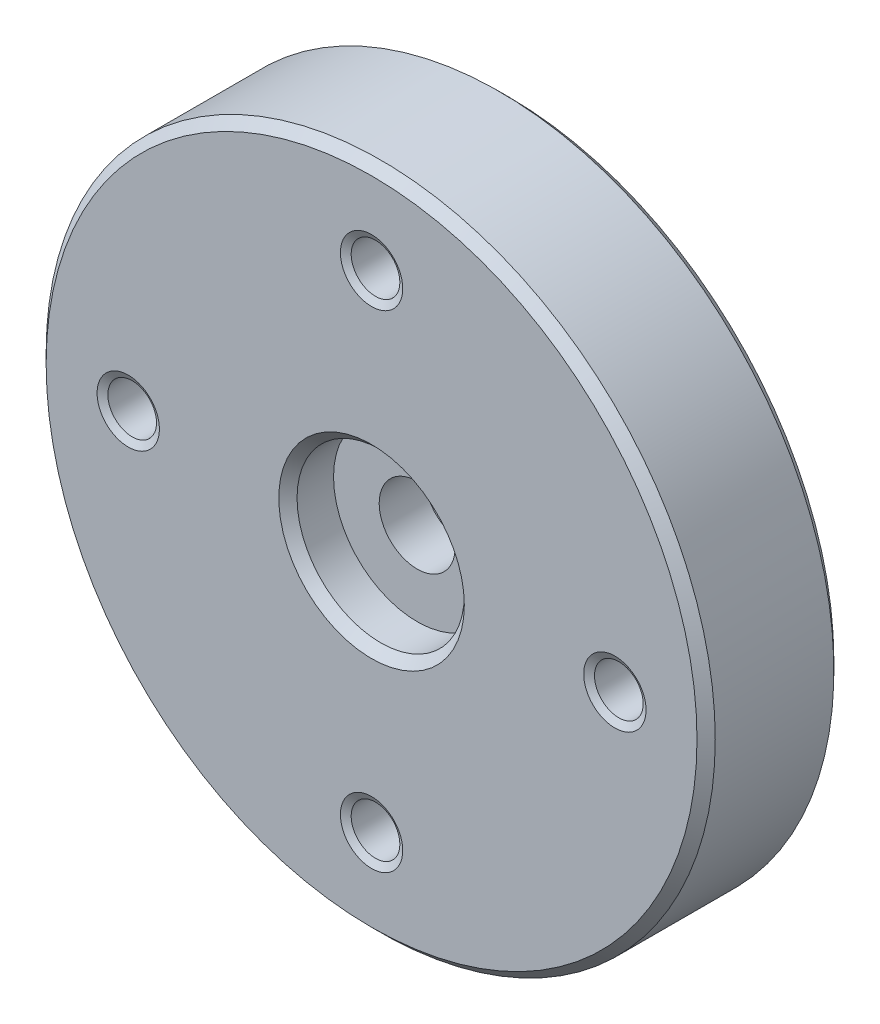
ISO-10303-21;
HEADER;
FILE_DESCRIPTION(('STEP AP214'),'2;1');
FILE_NAME('part.step','',(''),(''),'','','');
FILE_SCHEMA(('AUTOMOTIVE_DESIGN { 1 0 10303 214 1 1 1 1 }'));
ENDSEC;
DATA;
#1=APPLICATION_CONTEXT('core data for automotive mechanical design processes');
#2=APPLICATION_PROTOCOL_DEFINITION('international standard','automotive_design',2000,#1);
#3=PRODUCT_CONTEXT('',#1,'mechanical');
#4=PRODUCT('Part','Part','',(#3));
#5=PRODUCT_RELATED_PRODUCT_CATEGORY('part','',(#4));
#6=PRODUCT_DEFINITION_FORMATION('','',#4);
#7=PRODUCT_DEFINITION_CONTEXT('part definition',#1,'design');
#8=PRODUCT_DEFINITION('design','',#6,#7);
#9=PRODUCT_DEFINITION_SHAPE('','',#8);
#10=(LENGTH_UNIT() NAMED_UNIT(*) SI_UNIT(.MILLI.,.METRE.));
#11=(NAMED_UNIT(*) PLANE_ANGLE_UNIT() SI_UNIT($,.RADIAN.));
#12=(NAMED_UNIT(*) SI_UNIT($,.STERADIAN.) SOLID_ANGLE_UNIT());
#13=UNCERTAINTY_MEASURE_WITH_UNIT(LENGTH_MEASURE(1.E-05),#10,'distance_accuracy_value','');
#14=(GEOMETRIC_REPRESENTATION_CONTEXT(3) GLOBAL_UNCERTAINTY_ASSIGNED_CONTEXT((#13)) GLOBAL_UNIT_ASSIGNED_CONTEXT((#10,
#11,#12)) REPRESENTATION_CONTEXT('',''));
#15=CARTESIAN_POINT('',(0.,0.,0.));
#16=DIRECTION('',(0.,0.,1.));
#17=DIRECTION('',(1.,0.,0.));
#18=AXIS2_PLACEMENT_3D('',#15,#16,#17);
#19=CARTESIAN_POINT('',(0.,0.,0.));
#20=DIRECTION('',(0.,0.,-1.));
#21=DIRECTION('',(-1.,0.,0.));
#22=AXIS2_PLACEMENT_3D('',#19,#20,#21);
#23=CYLINDRICAL_SURFACE('',#22,2.75);
#24=CARTESIAN_POINT('',(0.,0.,-0.300000000000006));
#25=DIRECTION('',(0.,0.,1.));
#26=DIRECTION('',(1.,0.,0.));
#27=AXIS2_PLACEMENT_3D('',#24,#25,#26);
#28=CIRCLE('',#27,2.75);
#29=CARTESIAN_POINT('',(2.75,0.,-0.300000000000006));
#30=VERTEX_POINT('',#29);
#31=EDGE_CURVE('E64',#30,#30,#28,.T.);
#32=ORIENTED_EDGE('',*,*,#31,.T.);
#33=EDGE_LOOP('',(#32));
#34=FACE_BOUND('',#33,.T.);
#35=CARTESIAN_POINT('',(0.,0.,-1.5));
#36=DIRECTION('',(0.,0.,-1.));
#37=DIRECTION('',(-1.,0.,0.));
#38=AXIS2_PLACEMENT_3D('',#35,#36,#37);
#39=CIRCLE('',#38,2.75);
#40=CARTESIAN_POINT('',(-2.75,0.,-1.5));
#41=VERTEX_POINT('',#40);
#42=EDGE_CURVE('E88',#41,#41,#39,.T.);
#43=ORIENTED_EDGE('',*,*,#42,.T.);
#44=EDGE_LOOP('',(#43));
#45=FACE_BOUND('',#44,.T.);
#46=ADVANCED_FACE('F41',(#34,#45),#23,.F.);
#47=CARTESIAN_POINT('',(0.,2.75,0.));
#48=DIRECTION('',(0.,0.,1.));
#49=DIRECTION('',(1.,0.,0.));
#50=AXIS2_PLACEMENT_3D('',#47,#48,#49);
#51=PLANE('',#50);
#52=CARTESIAN_POINT('',(0.,0.,0.));
#53=DIRECTION('',(0.,0.,1.));
#54=DIRECTION('',(1.,0.,0.));
#55=AXIS2_PLACEMENT_3D('',#52,#53,#54);
#56=CIRCLE('',#55,3.05);
#57=CARTESIAN_POINT('',(3.05,0.,0.));
#58=VERTEX_POINT('',#57);
#59=EDGE_CURVE('E67',#58,#58,#56,.F.);
#60=ORIENTED_EDGE('',*,*,#59,.T.);
#61=EDGE_LOOP('',(#60));
#62=FACE_BOUND('',#61,.T.);
#63=CARTESIAN_POINT('',(0.,0.,0.));
#64=DIRECTION('',(0.,0.,1.));
#65=DIRECTION('',(1.,0.,0.));
#66=AXIS2_PLACEMENT_3D('',#63,#64,#65);
#67=CIRCLE('',#66,10.7);
#68=CARTESIAN_POINT('',(10.7,0.,0.));
#69=VERTEX_POINT('',#68);
#70=EDGE_CURVE('E70',#69,#69,#67,.T.);
#71=ORIENTED_EDGE('',*,*,#70,.T.);
#72=EDGE_LOOP('',(#71));
#73=FACE_BOUND('',#72,.T.);
#74=CARTESIAN_POINT('',(0.,8.,0.));
#75=DIRECTION('',(0.,0.,1.));
#76=DIRECTION('',(1.,0.,0.));
#77=AXIS2_PLACEMENT_3D('',#74,#75,#76);
#78=CIRCLE('',#77,1.025);
#79=CARTESIAN_POINT('',(1.025,8.,0.));
#80=VERTEX_POINT('',#79);
#81=EDGE_CURVE('E133',#80,#80,#78,.T.);
#82=ORIENTED_EDGE('',*,*,#81,.F.);
#83=EDGE_LOOP('',(#82));
#84=FACE_BOUND('',#83,.T.);
#85=CARTESIAN_POINT('',(8.,0.,0.));
#86=DIRECTION('',(0.,0.,1.));
#87=DIRECTION('',(1.,0.,0.));
#88=AXIS2_PLACEMENT_3D('',#85,#86,#87);
#89=CIRCLE('',#88,1.025);
#90=CARTESIAN_POINT('',(9.025,0.,0.));
#91=VERTEX_POINT('',#90);
#92=EDGE_CURVE('E121',#91,#91,#89,.T.);
#93=ORIENTED_EDGE('',*,*,#92,.F.);
#94=EDGE_LOOP('',(#93));
#95=FACE_BOUND('',#94,.T.);
#96=CARTESIAN_POINT('',(0.,-8.,0.));
#97=DIRECTION('',(0.,0.,1.));
#98=DIRECTION('',(1.,0.,0.));
#99=AXIS2_PLACEMENT_3D('',#96,#97,#98);
#100=CIRCLE('',#99,1.025);
#101=CARTESIAN_POINT('',(1.025,-8.,0.));
#102=VERTEX_POINT('',#101);
#103=EDGE_CURVE('E109',#102,#102,#100,.T.);
#104=ORIENTED_EDGE('',*,*,#103,.F.);
#105=EDGE_LOOP('',(#104));
#106=FACE_BOUND('',#105,.T.);
#107=CARTESIAN_POINT('',(-8.,0.,0.));
#108=DIRECTION('',(0.,0.,1.));
#109=DIRECTION('',(1.,0.,0.));
#110=AXIS2_PLACEMENT_3D('',#107,#108,#109);
#111=CIRCLE('',#110,1.025);
#112=CARTESIAN_POINT('',(-6.975,0.,0.));
#113=VERTEX_POINT('',#112);
#114=EDGE_CURVE('E97',#113,#113,#111,.T.);
#115=ORIENTED_EDGE('',*,*,#114,.F.);
#116=EDGE_LOOP('',(#115));
#117=FACE_BOUND('',#116,.T.);
#118=ADVANCED_FACE('F163',(#62,#73,#84,#95,#106,#117),#51,.T.);
#119=CARTESIAN_POINT('',(0.,0.,0.));
#120=DIRECTION('',(0.,0.,-1.));
#121=DIRECTION('',(-1.,0.,0.));
#122=AXIS2_PLACEMENT_3D('',#119,#120,#121);
#123=CYLINDRICAL_SURFACE('',#122,11.);
#124=CARTESIAN_POINT('',(0.,0.,-4.2));
#125=DIRECTION('',(0.,0.,-1.));
#126=DIRECTION('',(-1.,0.,0.));
#127=AXIS2_PLACEMENT_3D('',#124,#125,#126);
#128=CIRCLE('',#127,11.);
#129=CARTESIAN_POINT('',(-11.,0.,-4.2));
#130=VERTEX_POINT('',#129);
#131=EDGE_CURVE('E10',#130,#130,#128,.F.);
#132=ORIENTED_EDGE('',*,*,#131,.T.);
#133=EDGE_LOOP('',(#132));
#134=FACE_BOUND('',#133,.T.);
#135=CARTESIAN_POINT('',(0.,0.,-0.299999999999998));
#136=DIRECTION('',(0.,0.,1.));
#137=DIRECTION('',(1.,0.,0.));
#138=AXIS2_PLACEMENT_3D('',#135,#136,#137);
#139=CIRCLE('',#138,11.);
#140=CARTESIAN_POINT('',(11.,0.,-0.299999999999998));
#141=VERTEX_POINT('',#140);
#142=EDGE_CURVE('E48',#141,#141,#139,.F.);
#143=ORIENTED_EDGE('',*,*,#142,.T.);
#144=EDGE_LOOP('',(#143));
#145=FACE_BOUND('',#144,.T.);
#146=ADVANCED_FACE('F166',(#134,#145),#123,.T.);
#147=CARTESIAN_POINT('',(0.,11.,-4.5));
#148=DIRECTION('',(0.,0.,-1.));
#149=DIRECTION('',(-1.,0.,0.));
#150=AXIS2_PLACEMENT_3D('',#147,#148,#149);
#151=PLANE('',#150);
#152=CARTESIAN_POINT('',(0.,0.,-4.5));
#153=DIRECTION('',(0.,0.,-1.));
#154=DIRECTION('',(-1.,0.,0.));
#155=AXIS2_PLACEMENT_3D('',#152,#153,#154);
#156=CIRCLE('',#155,10.7);
#157=CARTESIAN_POINT('',(-10.7,0.,-4.5));
#158=VERTEX_POINT('',#157);
#159=EDGE_CURVE('E52',#158,#158,#156,.T.);
#160=ORIENTED_EDGE('',*,*,#159,.T.);
#161=EDGE_LOOP('',(#160));
#162=FACE_BOUND('',#161,.T.);
#163=CARTESIAN_POINT('',(0.,8.,-4.5));
#164=DIRECTION('',(0.,0.,1.));
#165=DIRECTION('',(1.,0.,0.));
#166=AXIS2_PLACEMENT_3D('',#163,#164,#165);
#167=CIRCLE('',#166,1.025);
#168=CARTESIAN_POINT('',(1.025,8.,-4.5));
#169=VERTEX_POINT('',#168);
#170=EDGE_CURVE('E136',#169,#169,#167,.T.);
#171=ORIENTED_EDGE('',*,*,#170,.T.);
#172=EDGE_LOOP('',(#171));
#173=FACE_BOUND('',#172,.T.);
#174=CARTESIAN_POINT('',(8.,0.,-4.5));
#175=DIRECTION('',(0.,0.,1.));
#176=DIRECTION('',(1.,0.,0.));
#177=AXIS2_PLACEMENT_3D('',#174,#175,#176);
#178=CIRCLE('',#177,1.025);
#179=CARTESIAN_POINT('',(9.025,0.,-4.5));
#180=VERTEX_POINT('',#179);
#181=EDGE_CURVE('E124',#180,#180,#178,.T.);
#182=ORIENTED_EDGE('',*,*,#181,.T.);
#183=EDGE_LOOP('',(#182));
#184=FACE_BOUND('',#183,.T.);
#185=CARTESIAN_POINT('',(0.,-8.,-4.5));
#186=DIRECTION('',(0.,0.,1.));
#187=DIRECTION('',(1.,0.,0.));
#188=AXIS2_PLACEMENT_3D('',#185,#186,#187);
#189=CIRCLE('',#188,1.025);
#190=CARTESIAN_POINT('',(1.025,-8.,-4.5));
#191=VERTEX_POINT('',#190);
#192=EDGE_CURVE('E112',#191,#191,#189,.T.);
#193=ORIENTED_EDGE('',*,*,#192,.T.);
#194=EDGE_LOOP('',(#193));
#195=FACE_BOUND('',#194,.T.);
#196=CARTESIAN_POINT('',(-8.,0.,-4.5));
#197=DIRECTION('',(0.,0.,1.));
#198=DIRECTION('',(1.,0.,0.));
#199=AXIS2_PLACEMENT_3D('',#196,#197,#198);
#200=CIRCLE('',#199,1.025);
#201=CARTESIAN_POINT('',(-6.975,0.,-4.5));
#202=VERTEX_POINT('',#201);
#203=EDGE_CURVE('E100',#202,#202,#200,.T.);
#204=ORIENTED_EDGE('',*,*,#203,.T.);
#205=EDGE_LOOP('',(#204));
#206=FACE_BOUND('',#205,.T.);
#207=CARTESIAN_POINT('',(0.,0.,-4.5));
#208=DIRECTION('',(0.,0.,-1.));
#209=DIRECTION('',(-1.,0.,0.));
#210=AXIS2_PLACEMENT_3D('',#207,#208,#209);
#211=CIRCLE('',#210,4.5);
#212=CARTESIAN_POINT('',(-4.5,0.,-4.5));
#213=VERTEX_POINT('',#212);
#214=EDGE_CURVE('E73',#213,#213,#211,.T.);
#215=ORIENTED_EDGE('',*,*,#214,.F.);
#216=EDGE_LOOP('',(#215));
#217=FACE_BOUND('',#216,.T.);
#218=ADVANCED_FACE('F140',(#162,#173,#184,#195,#206,#217),#151,.T.);
#219=CARTESIAN_POINT('',(0.,0.,0.));
#220=DIRECTION('',(0.,0.,-1.));
#221=DIRECTION('',(-1.,0.,0.));
#222=AXIS2_PLACEMENT_3D('',#219,#220,#221);
#223=CYLINDRICAL_SURFACE('',#222,4.5);
#224=CARTESIAN_POINT('',(0.,0.,-6.4));
#225=DIRECTION('',(0.,0.,-1.));
#226=DIRECTION('',(-1.,0.,0.));
#227=AXIS2_PLACEMENT_3D('',#224,#225,#226);
#228=CIRCLE('',#227,4.5);
#229=CARTESIAN_POINT('',(-4.5,0.,-6.4));
#230=VERTEX_POINT('',#229);
#231=EDGE_CURVE('E56',#230,#230,#228,.F.);
#232=ORIENTED_EDGE('',*,*,#231,.T.);
#233=EDGE_LOOP('',(#232));
#234=FACE_BOUND('',#233,.T.);
#235=ORIENTED_EDGE('',*,*,#214,.T.);
#236=EDGE_LOOP('',(#235));
#237=FACE_BOUND('',#236,.T.);
#238=ADVANCED_FACE('F218',(#234,#237),#223,.T.);
#239=CARTESIAN_POINT('',(0.,4.5,-6.7));
#240=DIRECTION('',(0.,0.,-1.));
#241=DIRECTION('',(-1.,0.,0.));
#242=AXIS2_PLACEMENT_3D('',#239,#240,#241);
#243=PLANE('',#242);
#244=CARTESIAN_POINT('',(0.,0.,-6.7));
#245=DIRECTION('',(0.,0.,-1.));
#246=DIRECTION('',(-1.,0.,0.));
#247=AXIS2_PLACEMENT_3D('',#244,#245,#246);
#248=CIRCLE('',#247,4.2);
#249=CARTESIAN_POINT('',(-4.2,0.,-6.7));
#250=VERTEX_POINT('',#249);
#251=EDGE_CURVE('E61',#250,#250,#248,.T.);
#252=ORIENTED_EDGE('',*,*,#251,.T.);
#253=EDGE_LOOP('',(#252));
#254=FACE_BOUND('',#253,.T.);
#255=CARTESIAN_POINT('',(0.,0.,-6.7));
#256=DIRECTION('',(0.,0.,-1.));
#257=DIRECTION('',(-1.,0.,0.));
#258=AXIS2_PLACEMENT_3D('',#255,#256,#257);
#259=CIRCLE('',#258,2.75);
#260=CARTESIAN_POINT('',(-2.75,0.,-6.7));
#261=VERTEX_POINT('',#260);
#262=EDGE_CURVE('E76',#261,#261,#259,.T.);
#263=ORIENTED_EDGE('',*,*,#262,.F.);
#264=EDGE_LOOP('',(#263));
#265=FACE_BOUND('',#264,.T.);
#266=ADVANCED_FACE('F224',(#254,#265),#243,.T.);
#267=CARTESIAN_POINT('',(0.,0.,0.));
#268=DIRECTION('',(0.,0.,-1.));
#269=DIRECTION('',(-1.,0.,0.));
#270=AXIS2_PLACEMENT_3D('',#267,#268,#269);
#271=CYLINDRICAL_SURFACE('',#270,2.75);
#272=ORIENTED_EDGE('',*,*,#262,.T.);
#273=EDGE_LOOP('',(#272));
#274=FACE_BOUND('',#273,.T.);
#275=CARTESIAN_POINT('',(0.,0.,-3.));
#276=DIRECTION('',(0.,0.,-1.));
#277=DIRECTION('',(-1.,0.,0.));
#278=AXIS2_PLACEMENT_3D('',#275,#276,#277);
#279=CIRCLE('',#278,2.75);
#280=CARTESIAN_POINT('',(-2.75,0.,-3.));
#281=VERTEX_POINT('',#280);
#282=EDGE_CURVE('E79',#281,#281,#279,.T.);
#283=ORIENTED_EDGE('',*,*,#282,.F.);
#284=EDGE_LOOP('',(#283));
#285=FACE_BOUND('',#284,.T.);
#286=ADVANCED_FACE('F230',(#274,#285),#271,.F.);
#287=CARTESIAN_POINT('',(0.,2.75,-3.));
#288=DIRECTION('',(0.,0.,-1.));
#289=DIRECTION('',(-1.,0.,0.));
#290=AXIS2_PLACEMENT_3D('',#287,#288,#289);
#291=PLANE('',#290);
#292=ORIENTED_EDGE('',*,*,#282,.T.);
#293=EDGE_LOOP('',(#292));
#294=FACE_BOUND('',#293,.T.);
#295=CARTESIAN_POINT('',(0.,0.,-3.));
#296=DIRECTION('',(0.,0.,-1.));
#297=DIRECTION('',(-1.,0.,0.));
#298=AXIS2_PLACEMENT_3D('',#295,#296,#297);
#299=CIRCLE('',#298,1.25);
#300=CARTESIAN_POINT('',(-1.25,0.,-3.));
#301=VERTEX_POINT('',#300);
#302=EDGE_CURVE('E82',#301,#301,#299,.T.);
#303=ORIENTED_EDGE('',*,*,#302,.F.);
#304=EDGE_LOOP('',(#303));
#305=FACE_BOUND('',#304,.T.);
#306=ADVANCED_FACE('F234',(#294,#305),#291,.T.);
#307=CARTESIAN_POINT('',(0.,0.,0.));
#308=DIRECTION('',(0.,0.,-1.));
#309=DIRECTION('',(-1.,0.,0.));
#310=AXIS2_PLACEMENT_3D('',#307,#308,#309);
#311=CYLINDRICAL_SURFACE('',#310,1.25);
#312=ORIENTED_EDGE('',*,*,#302,.T.);
#313=EDGE_LOOP('',(#312));
#314=FACE_BOUND('',#313,.T.);
#315=CARTESIAN_POINT('',(0.,0.,-1.5));
#316=DIRECTION('',(0.,0.,-1.));
#317=DIRECTION('',(-1.,0.,0.));
#318=AXIS2_PLACEMENT_3D('',#315,#316,#317);
#319=CIRCLE('',#318,1.25);
#320=CARTESIAN_POINT('',(-1.25,0.,-1.5));
#321=VERTEX_POINT('',#320);
#322=EDGE_CURVE('E85',#321,#321,#319,.T.);
#323=ORIENTED_EDGE('',*,*,#322,.F.);
#324=EDGE_LOOP('',(#323));
#325=FACE_BOUND('',#324,.T.);
#326=ADVANCED_FACE('F238',(#314,#325),#311,.F.);
#327=CARTESIAN_POINT('',(0.,2.75,-1.5));
#328=DIRECTION('',(0.,0.,1.));
#329=DIRECTION('',(1.,0.,0.));
#330=AXIS2_PLACEMENT_3D('',#327,#328,#329);
#331=PLANE('',#330);
#332=ORIENTED_EDGE('',*,*,#322,.T.);
#333=EDGE_LOOP('',(#332));
#334=FACE_BOUND('',#333,.T.);
#335=ORIENTED_EDGE('',*,*,#42,.F.);
#336=EDGE_LOOP('',(#335));
#337=FACE_BOUND('',#336,.T.);
#338=ADVANCED_FACE('F242',(#334,#337),#331,.T.);
#339=CARTESIAN_POINT('',(-8.,0.,-4.37009618943233));
#340=DIRECTION('',(0.,0.,-1.));
#341=DIRECTION('',(-1.,0.,0.));
#342=AXIS2_PLACEMENT_3D('',#339,#340,#341);
#343=CONICAL_SURFACE('',#342,0.799999999999999,1.0471975511966);
#344=ORIENTED_EDGE('',*,*,#203,.F.);
#345=EDGE_LOOP('',(#344));
#346=FACE_BOUND('',#345,.T.);
#347=CARTESIAN_POINT('',(-8.,0.,-4.37009618943233));
#348=DIRECTION('',(0.,0.,1.));
#349=DIRECTION('',(1.,0.,0.));
#350=AXIS2_PLACEMENT_3D('',#347,#348,#349);
#351=CIRCLE('',#350,0.799999999999999);
#352=CARTESIAN_POINT('',(-7.2,0.,-4.37009618943233));
#353=VERTEX_POINT('',#352);
#354=EDGE_CURVE('E91',#353,#353,#351,.T.);
#355=ORIENTED_EDGE('',*,*,#354,.T.);
#356=EDGE_LOOP('',(#355));
#357=FACE_BOUND('',#356,.T.);
#358=ADVANCED_FACE('F189',(#346,#357),#343,.F.);
#359=CARTESIAN_POINT('',(-8.,0.,0.));
#360=DIRECTION('',(0.,0.,1.));
#361=DIRECTION('',(1.,0.,0.));
#362=AXIS2_PLACEMENT_3D('',#359,#360,#361);
#363=CYLINDRICAL_SURFACE('',#362,0.799999999999999);
#364=ORIENTED_EDGE('',*,*,#354,.F.);
#365=EDGE_LOOP('',(#364));
#366=FACE_BOUND('',#365,.T.);
#367=CARTESIAN_POINT('',(-8.,0.,-0.129903810567662));
#368=DIRECTION('',(0.,0.,1.));
#369=DIRECTION('',(1.,0.,0.));
#370=AXIS2_PLACEMENT_3D('',#367,#368,#369);
#371=CIRCLE('',#370,0.8);
#372=CARTESIAN_POINT('',(-7.2,0.,-0.129903810567662));
#373=VERTEX_POINT('',#372);
#374=EDGE_CURVE('E94',#373,#373,#371,.T.);
#375=ORIENTED_EDGE('',*,*,#374,.T.);
#376=EDGE_LOOP('',(#375));
#377=FACE_BOUND('',#376,.T.);
#378=ADVANCED_FACE('F178',(#366,#377),#363,.F.);
#379=CARTESIAN_POINT('',(-8.,0.,0.));
#380=DIRECTION('',(0.,0.,1.));
#381=DIRECTION('',(1.,0.,0.));
#382=AXIS2_PLACEMENT_3D('',#379,#380,#381);
#383=CONICAL_SURFACE('',#382,1.025,1.0471975511966);
#384=ORIENTED_EDGE('',*,*,#374,.F.);
#385=EDGE_LOOP('',(#384));
#386=FACE_BOUND('',#385,.T.);
#387=ORIENTED_EDGE('',*,*,#114,.T.);
#388=EDGE_LOOP('',(#387));
#389=FACE_BOUND('',#388,.T.);
#390=ADVANCED_FACE('F175',(#386,#389),#383,.F.);
#391=CARTESIAN_POINT('',(0.,-8.,-4.37009618943233));
#392=DIRECTION('',(0.,0.,-1.));
#393=DIRECTION('',(-1.,0.,0.));
#394=AXIS2_PLACEMENT_3D('',#391,#392,#393);
#395=CONICAL_SURFACE('',#394,0.799999999999999,1.0471975511966);
#396=ORIENTED_EDGE('',*,*,#192,.F.);
#397=EDGE_LOOP('',(#396));
#398=FACE_BOUND('',#397,.T.);
#399=CARTESIAN_POINT('',(0.,-8.,-4.37009618943233));
#400=DIRECTION('',(0.,0.,1.));
#401=DIRECTION('',(1.,0.,0.));
#402=AXIS2_PLACEMENT_3D('',#399,#400,#401);
#403=CIRCLE('',#402,0.799999999999999);
#404=CARTESIAN_POINT('',(0.799999999999999,-8.,-4.37009618943233));
#405=VERTEX_POINT('',#404);
#406=EDGE_CURVE('E103',#405,#405,#403,.T.);
#407=ORIENTED_EDGE('',*,*,#406,.T.);
#408=EDGE_LOOP('',(#407));
#409=FACE_BOUND('',#408,.T.);
#410=ADVANCED_FACE('F177',(#398,#409),#395,.F.);
#411=CARTESIAN_POINT('',(0.,-8.,0.));
#412=DIRECTION('',(0.,0.,1.));
#413=DIRECTION('',(1.,0.,0.));
#414=AXIS2_PLACEMENT_3D('',#411,#412,#413);
#415=CYLINDRICAL_SURFACE('',#414,0.799999999999999);
#416=ORIENTED_EDGE('',*,*,#406,.F.);
#417=EDGE_LOOP('',(#416));
#418=FACE_BOUND('',#417,.T.);
#419=CARTESIAN_POINT('',(0.,-8.,-0.129903810567662));
#420=DIRECTION('',(0.,0.,1.));
#421=DIRECTION('',(1.,0.,0.));
#422=AXIS2_PLACEMENT_3D('',#419,#420,#421);
#423=CIRCLE('',#422,0.8);
#424=CARTESIAN_POINT('',(0.8,-8.,-0.129903810567662));
#425=VERTEX_POINT('',#424);
#426=EDGE_CURVE('E106',#425,#425,#423,.T.);
#427=ORIENTED_EDGE('',*,*,#426,.T.);
#428=EDGE_LOOP('',(#427));
#429=FACE_BOUND('',#428,.T.);
#430=ADVANCED_FACE('F185',(#418,#429),#415,.F.);
#431=CARTESIAN_POINT('',(0.,-8.,0.));
#432=DIRECTION('',(0.,0.,1.));
#433=DIRECTION('',(1.,0.,0.));
#434=AXIS2_PLACEMENT_3D('',#431,#432,#433);
#435=CONICAL_SURFACE('',#434,1.025,1.0471975511966);
#436=ORIENTED_EDGE('',*,*,#426,.F.);
#437=EDGE_LOOP('',(#436));
#438=FACE_BOUND('',#437,.T.);
#439=ORIENTED_EDGE('',*,*,#103,.T.);
#440=EDGE_LOOP('',(#439));
#441=FACE_BOUND('',#440,.T.);
#442=ADVANCED_FACE('F296',(#438,#441),#435,.F.);
#443=CARTESIAN_POINT('',(8.,0.,-4.37009618943233));
#444=DIRECTION('',(0.,0.,-1.));
#445=DIRECTION('',(-1.,0.,0.));
#446=AXIS2_PLACEMENT_3D('',#443,#444,#445);
#447=CONICAL_SURFACE('',#446,0.799999999999999,1.04719755119659);
#448=ORIENTED_EDGE('',*,*,#181,.F.);
#449=EDGE_LOOP('',(#448));
#450=FACE_BOUND('',#449,.T.);
#451=CARTESIAN_POINT('',(8.,0.,-4.37009618943233));
#452=DIRECTION('',(0.,0.,1.));
#453=DIRECTION('',(1.,0.,0.));
#454=AXIS2_PLACEMENT_3D('',#451,#452,#453);
#455=CIRCLE('',#454,0.799999999999999);
#456=CARTESIAN_POINT('',(8.8,0.,-4.37009618943233));
#457=VERTEX_POINT('',#456);
#458=EDGE_CURVE('E115',#457,#457,#455,.T.);
#459=ORIENTED_EDGE('',*,*,#458,.T.);
#460=EDGE_LOOP('',(#459));
#461=FACE_BOUND('',#460,.T.);
#462=ADVANCED_FACE('F288',(#450,#461),#447,.F.);
#463=CARTESIAN_POINT('',(8.,0.,0.));
#464=DIRECTION('',(0.,0.,1.));
#465=DIRECTION('',(1.,0.,0.));
#466=AXIS2_PLACEMENT_3D('',#463,#464,#465);
#467=CYLINDRICAL_SURFACE('',#466,0.799999999999999);
#468=ORIENTED_EDGE('',*,*,#458,.F.);
#469=EDGE_LOOP('',(#468));
#470=FACE_BOUND('',#469,.T.);
#471=CARTESIAN_POINT('',(8.,0.,-0.129903810567662));
#472=DIRECTION('',(0.,0.,1.));
#473=DIRECTION('',(1.,0.,0.));
#474=AXIS2_PLACEMENT_3D('',#471,#472,#473);
#475=CIRCLE('',#474,0.8);
#476=CARTESIAN_POINT('',(8.8,0.,-0.129903810567662));
#477=VERTEX_POINT('',#476);
#478=EDGE_CURVE('E118',#477,#477,#475,.T.);
#479=ORIENTED_EDGE('',*,*,#478,.T.);
#480=EDGE_LOOP('',(#479));
#481=FACE_BOUND('',#480,.T.);
#482=ADVANCED_FACE('F286',(#470,#481),#467,.F.);
#483=CARTESIAN_POINT('',(8.,0.,0.));
#484=DIRECTION('',(0.,0.,1.));
#485=DIRECTION('',(1.,0.,0.));
#486=AXIS2_PLACEMENT_3D('',#483,#484,#485);
#487=CONICAL_SURFACE('',#486,1.025,1.0471975511966);
#488=ORIENTED_EDGE('',*,*,#478,.F.);
#489=EDGE_LOOP('',(#488));
#490=FACE_BOUND('',#489,.T.);
#491=ORIENTED_EDGE('',*,*,#92,.T.);
#492=EDGE_LOOP('',(#491));
#493=FACE_BOUND('',#492,.T.);
#494=ADVANCED_FACE('F147',(#490,#493),#487,.F.);
#495=CARTESIAN_POINT('',(0.,8.,-4.37009618943233));
#496=DIRECTION('',(0.,0.,-1.));
#497=DIRECTION('',(-1.,0.,0.));
#498=AXIS2_PLACEMENT_3D('',#495,#496,#497);
#499=CONICAL_SURFACE('',#498,0.799999999999999,1.0471975511966);
#500=ORIENTED_EDGE('',*,*,#170,.F.);
#501=EDGE_LOOP('',(#500));
#502=FACE_BOUND('',#501,.T.);
#503=CARTESIAN_POINT('',(0.,8.,-4.37009618943233));
#504=DIRECTION('',(0.,0.,1.));
#505=DIRECTION('',(1.,0.,0.));
#506=AXIS2_PLACEMENT_3D('',#503,#504,#505);
#507=CIRCLE('',#506,0.799999999999999);
#508=CARTESIAN_POINT('',(0.799999999999999,8.,-4.37009618943233));
#509=VERTEX_POINT('',#508);
#510=EDGE_CURVE('E127',#509,#509,#507,.T.);
#511=ORIENTED_EDGE('',*,*,#510,.T.);
#512=EDGE_LOOP('',(#511));
#513=FACE_BOUND('',#512,.T.);
#514=ADVANCED_FACE('F143',(#502,#513),#499,.F.);
#515=CARTESIAN_POINT('',(0.,8.,0.));
#516=DIRECTION('',(0.,0.,1.));
#517=DIRECTION('',(1.,0.,0.));
#518=AXIS2_PLACEMENT_3D('',#515,#516,#517);
#519=CYLINDRICAL_SURFACE('',#518,0.799999999999999);
#520=ORIENTED_EDGE('',*,*,#510,.F.);
#521=EDGE_LOOP('',(#520));
#522=FACE_BOUND('',#521,.T.);
#523=CARTESIAN_POINT('',(0.,8.,-0.129903810567662));
#524=DIRECTION('',(0.,0.,1.));
#525=DIRECTION('',(1.,0.,0.));
#526=AXIS2_PLACEMENT_3D('',#523,#524,#525);
#527=CIRCLE('',#526,0.8);
#528=CARTESIAN_POINT('',(0.8,8.,-0.129903810567662));
#529=VERTEX_POINT('',#528);
#530=EDGE_CURVE('E130',#529,#529,#527,.T.);
#531=ORIENTED_EDGE('',*,*,#530,.T.);
#532=EDGE_LOOP('',(#531));
#533=FACE_BOUND('',#532,.T.);
#534=ADVANCED_FACE('F146',(#522,#533),#519,.F.);
#535=CARTESIAN_POINT('',(0.,8.,0.));
#536=DIRECTION('',(0.,0.,1.));
#537=DIRECTION('',(1.,0.,0.));
#538=AXIS2_PLACEMENT_3D('',#535,#536,#537);
#539=CONICAL_SURFACE('',#538,1.025,1.0471975511966);
#540=ORIENTED_EDGE('',*,*,#530,.F.);
#541=EDGE_LOOP('',(#540));
#542=FACE_BOUND('',#541,.T.);
#543=ORIENTED_EDGE('',*,*,#81,.T.);
#544=EDGE_LOOP('',(#543));
#545=FACE_BOUND('',#544,.T.);
#546=ADVANCED_FACE('F153',(#542,#545),#539,.F.);
#547=CARTESIAN_POINT('',(0.,0.,0.));
#548=DIRECTION('',(0.,0.,1.));
#549=DIRECTION('',(1.,0.,0.));
#550=AXIS2_PLACEMENT_3D('',#547,#548,#549);
#551=CONICAL_SURFACE('',#550,3.05,0.78539816339744);
#552=ORIENTED_EDGE('',*,*,#31,.F.);
#553=EDGE_LOOP('',(#552));
#554=FACE_BOUND('',#553,.T.);
#555=ORIENTED_EDGE('',*,*,#59,.F.);
#556=EDGE_LOOP('',(#555));
#557=FACE_BOUND('',#556,.T.);
#558=ADVANCED_FACE('F159',(#554,#557),#551,.F.);
#559=CARTESIAN_POINT('',(0.,0.,-6.7));
#560=DIRECTION('',(0.,0.,1.));
#561=DIRECTION('',(1.,0.,0.));
#562=AXIS2_PLACEMENT_3D('',#559,#560,#561);
#563=CONICAL_SURFACE('',#562,4.2,0.785398163397445);
#564=ORIENTED_EDGE('',*,*,#231,.F.);
#565=EDGE_LOOP('',(#564));
#566=FACE_BOUND('',#565,.T.);
#567=ORIENTED_EDGE('',*,*,#251,.F.);
#568=EDGE_LOOP('',(#567));
#569=FACE_BOUND('',#568,.T.);
#570=ADVANCED_FACE('F203',(#566,#569),#563,.T.);
#571=CARTESIAN_POINT('',(0.,0.,-4.5));
#572=DIRECTION('',(0.,0.,1.));
#573=DIRECTION('',(1.,0.,0.));
#574=AXIS2_PLACEMENT_3D('',#571,#572,#573);
#575=CONICAL_SURFACE('',#574,10.7,0.785398163397451);
#576=ORIENTED_EDGE('',*,*,#131,.F.);
#577=EDGE_LOOP('',(#576));
#578=FACE_BOUND('',#577,.T.);
#579=ORIENTED_EDGE('',*,*,#159,.F.);
#580=EDGE_LOOP('',(#579));
#581=FACE_BOUND('',#580,.T.);
#582=ADVANCED_FACE('F206',(#578,#581),#575,.T.);
#583=CARTESIAN_POINT('',(0.,0.,-0.299999999999998));
#584=DIRECTION('',(0.,0.,-1.));
#585=DIRECTION('',(-1.,0.,0.));
#586=AXIS2_PLACEMENT_3D('',#583,#584,#585);
#587=CONICAL_SURFACE('',#586,11.,0.785398163397451);
#588=ORIENTED_EDGE('',*,*,#70,.F.);
#589=EDGE_LOOP('',(#588));
#590=FACE_BOUND('',#589,.T.);
#591=ORIENTED_EDGE('',*,*,#142,.F.);
#592=EDGE_LOOP('',(#591));
#593=FACE_BOUND('',#592,.T.);
#594=ADVANCED_FACE('F43',(#590,#593),#587,.T.);
#595=CLOSED_SHELL('',(#46,#118,#146,#218,#238,#266,#286,#306,#326,#338,#358,#378,#390,#410,#430,
#442,#462,#482,#494,#514,#534,#546,#558,#570,#582,#594));
#596=MANIFOLD_SOLID_BREP('B2',#595);
#597=ADVANCED_BREP_SHAPE_REPRESENTATION('',(#18,#596),#14);
#598=SHAPE_DEFINITION_REPRESENTATION(#9,#597);
ENDSEC;
END-ISO-10303-21;
